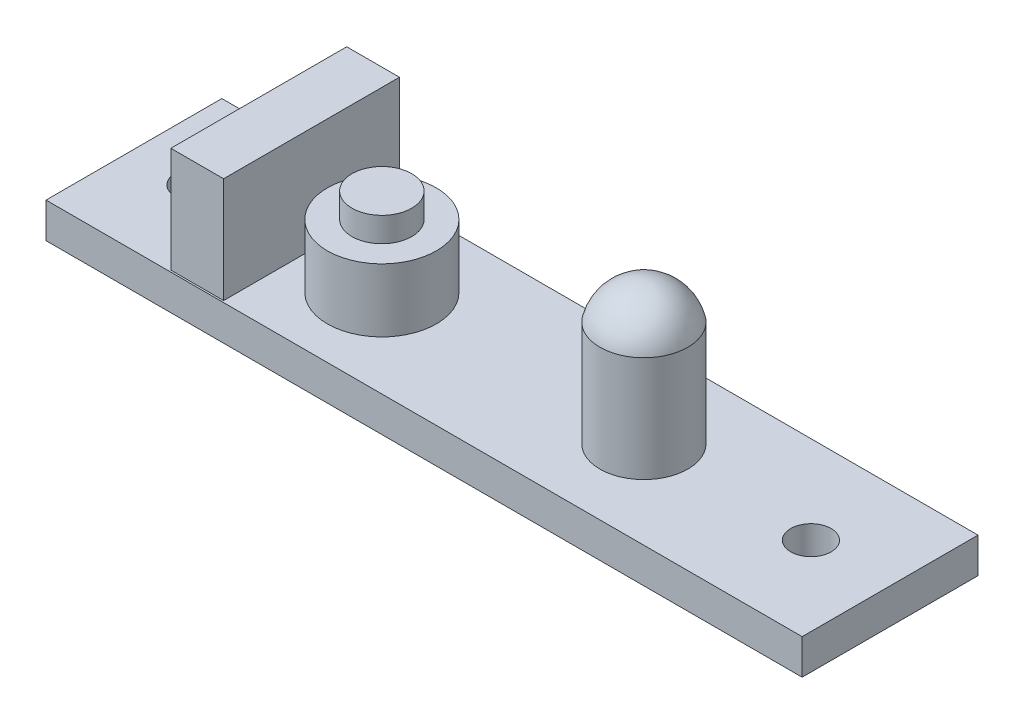
ISO-10303-21;
HEADER;
FILE_DESCRIPTION(('STEP AP214'),'2;1');
FILE_NAME('part.step','',(''),(''),'','','');
FILE_SCHEMA(('AUTOMOTIVE_DESIGN { 1 0 10303 214 1 1 1 1 }'));
ENDSEC;
DATA;
#1=APPLICATION_CONTEXT('core data for automotive mechanical design processes');
#2=APPLICATION_PROTOCOL_DEFINITION('international standard','automotive_design',2000,#1);
#3=PRODUCT_CONTEXT('',#1,'mechanical');
#4=PRODUCT('Part','Part','',(#3));
#5=PRODUCT_RELATED_PRODUCT_CATEGORY('part','',(#4));
#6=PRODUCT_DEFINITION_FORMATION('','',#4);
#7=PRODUCT_DEFINITION_CONTEXT('part definition',#1,'design');
#8=PRODUCT_DEFINITION('design','',#6,#7);
#9=PRODUCT_DEFINITION_SHAPE('','',#8);
#10=(LENGTH_UNIT() NAMED_UNIT(*) SI_UNIT(.MILLI.,.METRE.));
#11=(NAMED_UNIT(*) PLANE_ANGLE_UNIT() SI_UNIT($,.RADIAN.));
#12=(NAMED_UNIT(*) SI_UNIT($,.STERADIAN.) SOLID_ANGLE_UNIT());
#13=UNCERTAINTY_MEASURE_WITH_UNIT(LENGTH_MEASURE(1.E-05),#10,'distance_accuracy_value','');
#14=(GEOMETRIC_REPRESENTATION_CONTEXT(3) GLOBAL_UNCERTAINTY_ASSIGNED_CONTEXT((#13)) GLOBAL_UNIT_ASSIGNED_CONTEXT((#10,
#11,#12)) REPRESENTATION_CONTEXT('',''));
#15=CARTESIAN_POINT('',(0.,0.,0.));
#16=DIRECTION('',(0.,0.,1.));
#17=DIRECTION('',(1.,0.,0.));
#18=AXIS2_PLACEMENT_3D('',#15,#16,#17);
#19=CARTESIAN_POINT('',(21.5,2.,-5.));
#20=DIRECTION('',(-1.,0.,0.));
#21=DIRECTION('',(0.,0.,1.));
#22=AXIS2_PLACEMENT_3D('',#19,#20,#21);
#23=PLANE('',#22);
#24=DIRECTION('',(0.,0.,-1.));
#25=VECTOR('',#24,1.);
#26=CARTESIAN_POINT('',(21.5,0.,-5.));
#27=LINE('',#26,#25);
#28=CARTESIAN_POINT('',(21.5,0.,5.));
#29=VERTEX_POINT('',#28);
#30=CARTESIAN_POINT('',(21.5,0.,-5.));
#31=VERTEX_POINT('',#30);
#32=EDGE_CURVE('E126',#29,#31,#27,.T.);
#33=ORIENTED_EDGE('',*,*,#32,.T.);
#34=DIRECTION('',(0.,-1.,0.));
#35=VECTOR('',#34,1.);
#36=CARTESIAN_POINT('',(21.5,2.,-5.));
#37=LINE('',#36,#35);
#38=CARTESIAN_POINT('',(21.5,2.,-5.));
#39=VERTEX_POINT('',#38);
#40=EDGE_CURVE('E42',#39,#31,#37,.T.);
#41=ORIENTED_EDGE('',*,*,#40,.F.);
#42=DIRECTION('',(0.,0.,-1.));
#43=VECTOR('',#42,1.);
#44=CARTESIAN_POINT('',(21.5,2.,-5.));
#45=LINE('',#44,#43);
#46=CARTESIAN_POINT('',(21.5,2.,5.));
#47=VERTEX_POINT('',#46);
#48=EDGE_CURVE('E135',#47,#39,#45,.T.);
#49=ORIENTED_EDGE('',*,*,#48,.F.);
#50=DIRECTION('',(0.,-1.,0.));
#51=VECTOR('',#50,1.);
#52=CARTESIAN_POINT('',(21.5,2.,5.));
#53=LINE('',#52,#51);
#54=EDGE_CURVE('E147',#47,#29,#53,.T.);
#55=ORIENTED_EDGE('',*,*,#54,.T.);
#56=EDGE_LOOP('',(#33,#41,#49,#55));
#57=FACE_BOUND('',#56,.T.);
#58=ADVANCED_FACE('F33',(#57),#23,.F.);
#59=CARTESIAN_POINT('',(-21.5,2.,-5.));
#60=DIRECTION('',(0.,0.,1.));
#61=DIRECTION('',(1.,0.,0.));
#62=AXIS2_PLACEMENT_3D('',#59,#60,#61);
#63=PLANE('',#62);
#64=DIRECTION('',(-1.,0.,0.));
#65=VECTOR('',#64,1.);
#66=CARTESIAN_POINT('',(-21.5,0.,-5.));
#67=LINE('',#66,#65);
#68=CARTESIAN_POINT('',(-21.5,0.,-5.));
#69=VERTEX_POINT('',#68);
#70=EDGE_CURVE('E129',#31,#69,#67,.T.);
#71=ORIENTED_EDGE('',*,*,#70,.T.);
#72=DIRECTION('',(0.,-1.,0.));
#73=VECTOR('',#72,1.);
#74=CARTESIAN_POINT('',(-21.5,2.,-5.));
#75=LINE('',#74,#73);
#76=CARTESIAN_POINT('',(-21.5,2.,-5.));
#77=VERTEX_POINT('',#76);
#78=EDGE_CURVE('E158',#77,#69,#75,.T.);
#79=ORIENTED_EDGE('',*,*,#78,.F.);
#80=DIRECTION('',(-1.,0.,0.));
#81=VECTOR('',#80,1.);
#82=CARTESIAN_POINT('',(-21.5,2.,-5.));
#83=LINE('',#82,#81);
#84=CARTESIAN_POINT('',(-14.5,2.,-5.));
#85=VERTEX_POINT('',#84);
#86=EDGE_CURVE('E138',#85,#77,#83,.T.);
#87=ORIENTED_EDGE('',*,*,#86,.F.);
#88=CARTESIAN_POINT('',(-11.5,2.,-5.));
#89=VERTEX_POINT('',#88);
#90=EDGE_CURVE('E144',#89,#85,#83,.T.);
#91=ORIENTED_EDGE('',*,*,#90,.F.);
#92=EDGE_CURVE('E140',#39,#89,#83,.T.);
#93=ORIENTED_EDGE('',*,*,#92,.F.);
#94=ORIENTED_EDGE('',*,*,#40,.T.);
#95=EDGE_LOOP('',(#71,#79,#87,#91,#93,#94));
#96=FACE_BOUND('',#95,.T.);
#97=ADVANCED_FACE('F163',(#96),#63,.F.);
#98=CARTESIAN_POINT('',(-21.5,2.,-5.));
#99=DIRECTION('',(1.,0.,0.));
#100=DIRECTION('',(0.,0.,-1.));
#101=AXIS2_PLACEMENT_3D('',#98,#99,#100);
#102=PLANE('',#101);
#103=DIRECTION('',(0.,0.,1.));
#104=VECTOR('',#103,1.);
#105=CARTESIAN_POINT('',(-21.5,0.,-5.));
#106=LINE('',#105,#104);
#107=CARTESIAN_POINT('',(-21.5,0.,5.));
#108=VERTEX_POINT('',#107);
#109=EDGE_CURVE('E150',#69,#108,#106,.T.);
#110=ORIENTED_EDGE('',*,*,#109,.T.);
#111=DIRECTION('',(0.,-1.,0.));
#112=VECTOR('',#111,1.);
#113=CARTESIAN_POINT('',(-21.5,2.,5.));
#114=LINE('',#113,#112);
#115=CARTESIAN_POINT('',(-21.5,2.,5.));
#116=VERTEX_POINT('',#115);
#117=EDGE_CURVE('E155',#116,#108,#114,.T.);
#118=ORIENTED_EDGE('',*,*,#117,.F.);
#119=DIRECTION('',(0.,0.,1.));
#120=VECTOR('',#119,1.);
#121=CARTESIAN_POINT('',(-21.5,2.,-5.));
#122=LINE('',#121,#120);
#123=EDGE_CURVE('E143',#77,#116,#122,.T.);
#124=ORIENTED_EDGE('',*,*,#123,.F.);
#125=ORIENTED_EDGE('',*,*,#78,.T.);
#126=EDGE_LOOP('',(#110,#118,#124,#125));
#127=FACE_BOUND('',#126,.T.);
#128=ADVANCED_FACE('F175',(#127),#102,.F.);
#129=CARTESIAN_POINT('',(-21.5,2.,5.));
#130=DIRECTION('',(0.,0.,-1.));
#131=DIRECTION('',(-1.,0.,0.));
#132=AXIS2_PLACEMENT_3D('',#129,#130,#131);
#133=PLANE('',#132);
#134=DIRECTION('',(1.,0.,0.));
#135=VECTOR('',#134,1.);
#136=CARTESIAN_POINT('',(-21.5,0.,5.));
#137=LINE('',#136,#135);
#138=EDGE_CURVE('E139',#108,#29,#137,.T.);
#139=ORIENTED_EDGE('',*,*,#138,.T.);
#140=ORIENTED_EDGE('',*,*,#54,.F.);
#141=DIRECTION('',(1.,0.,0.));
#142=VECTOR('',#141,1.);
#143=CARTESIAN_POINT('',(-21.5,2.,5.));
#144=LINE('',#143,#142);
#145=EDGE_CURVE('E146',#116,#47,#144,.T.);
#146=ORIENTED_EDGE('',*,*,#145,.F.);
#147=ORIENTED_EDGE('',*,*,#117,.T.);
#148=EDGE_LOOP('',(#139,#140,#146,#147));
#149=FACE_BOUND('',#148,.T.);
#150=ADVANCED_FACE('F179',(#149),#133,.F.);
#151=CARTESIAN_POINT('',(0.,2.,0.));
#152=DIRECTION('',(0.,1.,0.));
#153=DIRECTION('',(0.,0.,1.));
#154=AXIS2_PLACEMENT_3D('',#151,#152,#153);
#155=PLANE('',#154);
#156=CARTESIAN_POINT('',(17.,2.,0.));
#157=DIRECTION('',(0.,1.,0.));
#158=DIRECTION('',(0.,0.,1.));
#159=AXIS2_PLACEMENT_3D('',#156,#157,#158);
#160=CIRCLE('',#159,1.15);
#161=CARTESIAN_POINT('',(17.,2.,1.15));
#162=VERTEX_POINT('',#161);
#163=EDGE_CURVE('E225',#162,#162,#160,.T.);
#164=ORIENTED_EDGE('',*,*,#163,.F.);
#165=EDGE_LOOP('',(#164));
#166=FACE_BOUND('',#165,.T.);
#167=CARTESIAN_POINT('',(-18.,2.,0.));
#168=DIRECTION('',(0.,1.,0.));
#169=DIRECTION('',(0.,0.,1.));
#170=AXIS2_PLACEMENT_3D('',#167,#168,#169);
#171=CIRCLE('',#170,1.15);
#172=CARTESIAN_POINT('',(-18.,2.,1.15));
#173=VERTEX_POINT('',#172);
#174=EDGE_CURVE('E219',#173,#173,#171,.T.);
#175=ORIENTED_EDGE('',*,*,#174,.F.);
#176=EDGE_LOOP('',(#175));
#177=FACE_BOUND('',#176,.T.);
#178=CARTESIAN_POINT('',(7.49999999999998,2.,0.));
#179=DIRECTION('',(0.,1.,0.));
#180=DIRECTION('',(0.,0.,1.));
#181=AXIS2_PLACEMENT_3D('',#178,#179,#180);
#182=CIRCLE('',#181,2.5);
#183=CARTESIAN_POINT('',(7.49999999999998,2.,2.5));
#184=VERTEX_POINT('',#183);
#185=EDGE_CURVE('E216',#184,#184,#182,.T.);
#186=ORIENTED_EDGE('',*,*,#185,.F.);
#187=EDGE_LOOP('',(#186));
#188=FACE_BOUND('',#187,.T.);
#189=CARTESIAN_POINT('',(-7.40000000000001,2.,0.));
#190=DIRECTION('',(0.,1.,0.));
#191=DIRECTION('',(0.,0.,1.));
#192=AXIS2_PLACEMENT_3D('',#189,#190,#191);
#193=CIRCLE('',#192,3.1);
#194=CARTESIAN_POINT('',(-7.40000000000001,2.,3.1));
#195=VERTEX_POINT('',#194);
#196=EDGE_CURVE('E193',#195,#195,#193,.T.);
#197=ORIENTED_EDGE('',*,*,#196,.F.);
#198=EDGE_LOOP('',(#197));
#199=FACE_BOUND('',#198,.T.);
#200=DIRECTION('',(0.,0.,1.));
#201=VECTOR('',#200,1.);
#202=CARTESIAN_POINT('',(-14.5,2.,4.9));
#203=LINE('',#202,#201);
#204=CARTESIAN_POINT('',(-14.5,2.,4.9));
#205=VERTEX_POINT('',#204);
#206=EDGE_CURVE('E11',#85,#205,#203,.T.);
#207=ORIENTED_EDGE('',*,*,#206,.F.);
#208=ORIENTED_EDGE('',*,*,#86,.T.);
#209=ORIENTED_EDGE('',*,*,#123,.T.);
#210=ORIENTED_EDGE('',*,*,#145,.T.);
#211=ORIENTED_EDGE('',*,*,#48,.T.);
#212=ORIENTED_EDGE('',*,*,#92,.T.);
#213=DIRECTION('',(0.,0.,-1.));
#214=VECTOR('',#213,1.);
#215=CARTESIAN_POINT('',(-11.5,2.,4.9));
#216=LINE('',#215,#214);
#217=CARTESIAN_POINT('',(-11.5,2.,4.9));
#218=VERTEX_POINT('',#217);
#219=EDGE_CURVE('E198',#218,#89,#216,.T.);
#220=ORIENTED_EDGE('',*,*,#219,.F.);
#221=DIRECTION('',(1.,0.,0.));
#222=VECTOR('',#221,1.);
#223=CARTESIAN_POINT('',(-14.5,2.,4.9));
#224=LINE('',#223,#222);
#225=EDGE_CURVE('E51',#205,#218,#224,.T.);
#226=ORIENTED_EDGE('',*,*,#225,.F.);
#227=EDGE_LOOP('',(#207,#208,#209,#210,#211,#212,#220,#226));
#228=FACE_BOUND('',#227,.T.);
#229=ADVANCED_FACE('F180',(#166,#177,#188,#199,#228),#155,.T.);
#230=CARTESIAN_POINT('',(0.,0.,0.));
#231=DIRECTION('',(0.,1.,0.));
#232=DIRECTION('',(0.,0.,1.));
#233=AXIS2_PLACEMENT_3D('',#230,#231,#232);
#234=PLANE('',#233);
#235=CARTESIAN_POINT('',(17.,0.,0.));
#236=DIRECTION('',(0.,1.,0.));
#237=DIRECTION('',(0.,0.,1.));
#238=AXIS2_PLACEMENT_3D('',#235,#236,#237);
#239=CIRCLE('',#238,1.15);
#240=CARTESIAN_POINT('',(17.,0.,1.15));
#241=VERTEX_POINT('',#240);
#242=EDGE_CURVE('E228',#241,#241,#239,.T.);
#243=ORIENTED_EDGE('',*,*,#242,.T.);
#244=EDGE_LOOP('',(#243));
#245=FACE_BOUND('',#244,.T.);
#246=CARTESIAN_POINT('',(-18.,0.,0.));
#247=DIRECTION('',(0.,1.,0.));
#248=DIRECTION('',(0.,0.,1.));
#249=AXIS2_PLACEMENT_3D('',#246,#247,#248);
#250=CIRCLE('',#249,1.15);
#251=CARTESIAN_POINT('',(-18.,0.,1.15));
#252=VERTEX_POINT('',#251);
#253=EDGE_CURVE('E222',#252,#252,#250,.T.);
#254=ORIENTED_EDGE('',*,*,#253,.T.);
#255=EDGE_LOOP('',(#254));
#256=FACE_BOUND('',#255,.T.);
#257=ORIENTED_EDGE('',*,*,#32,.F.);
#258=ORIENTED_EDGE('',*,*,#138,.F.);
#259=ORIENTED_EDGE('',*,*,#109,.F.);
#260=ORIENTED_EDGE('',*,*,#70,.F.);
#261=EDGE_LOOP('',(#257,#258,#259,#260));
#262=FACE_BOUND('',#261,.T.);
#263=ADVANCED_FACE('F171',(#245,#256,#262),#234,.F.);
#264=CARTESIAN_POINT('',(-14.5,8.,4.9));
#265=DIRECTION('',(1.,0.,0.));
#266=DIRECTION('',(0.,0.,-1.));
#267=AXIS2_PLACEMENT_3D('',#264,#265,#266);
#268=PLANE('',#267);
#269=CARTESIAN_POINT('',(-14.5,2.,-5.1));
#270=VERTEX_POINT('',#269);
#271=EDGE_CURVE('E44',#270,#85,#203,.T.);
#272=ORIENTED_EDGE('',*,*,#271,.T.);
#273=ORIENTED_EDGE('',*,*,#206,.T.);
#274=DIRECTION('',(0.,-1.,0.));
#275=VECTOR('',#274,1.);
#276=CARTESIAN_POINT('',(-14.5,8.,4.9));
#277=LINE('',#276,#275);
#278=CARTESIAN_POINT('',(-14.5,8.,4.9));
#279=VERTEX_POINT('',#278);
#280=EDGE_CURVE('E107',#279,#205,#277,.T.);
#281=ORIENTED_EDGE('',*,*,#280,.F.);
#282=DIRECTION('',(0.,0.,1.));
#283=VECTOR('',#282,1.);
#284=CARTESIAN_POINT('',(-14.5,8.,4.9));
#285=LINE('',#284,#283);
#286=CARTESIAN_POINT('',(-14.5,8.,-5.1));
#287=VERTEX_POINT('',#286);
#288=EDGE_CURVE('E113',#287,#279,#285,.T.);
#289=ORIENTED_EDGE('',*,*,#288,.F.);
#290=DIRECTION('',(0.,-1.,0.));
#291=VECTOR('',#290,1.);
#292=CARTESIAN_POINT('',(-14.5,8.,-5.1));
#293=LINE('',#292,#291);
#294=EDGE_CURVE('E189',#287,#270,#293,.T.);
#295=ORIENTED_EDGE('',*,*,#294,.T.);
#296=EDGE_LOOP('',(#272,#273,#281,#289,#295));
#297=FACE_BOUND('',#296,.T.);
#298=ADVANCED_FACE('F125',(#297),#268,.F.);
#299=CARTESIAN_POINT('',(-14.5,8.,4.9));
#300=DIRECTION('',(0.,0.,-1.));
#301=DIRECTION('',(-1.,0.,0.));
#302=AXIS2_PLACEMENT_3D('',#299,#300,#301);
#303=PLANE('',#302);
#304=ORIENTED_EDGE('',*,*,#225,.T.);
#305=DIRECTION('',(0.,-1.,0.));
#306=VECTOR('',#305,1.);
#307=CARTESIAN_POINT('',(-11.5,8.,4.9));
#308=LINE('',#307,#306);
#309=CARTESIAN_POINT('',(-11.5,8.,4.9));
#310=VERTEX_POINT('',#309);
#311=EDGE_CURVE('E109',#310,#218,#308,.T.);
#312=ORIENTED_EDGE('',*,*,#311,.F.);
#313=DIRECTION('',(1.,0.,0.));
#314=VECTOR('',#313,1.);
#315=CARTESIAN_POINT('',(-14.5,8.,4.9));
#316=LINE('',#315,#314);
#317=EDGE_CURVE('E103',#279,#310,#316,.T.);
#318=ORIENTED_EDGE('',*,*,#317,.F.);
#319=ORIENTED_EDGE('',*,*,#280,.T.);
#320=EDGE_LOOP('',(#304,#312,#318,#319));
#321=FACE_BOUND('',#320,.T.);
#322=ADVANCED_FACE('F105',(#321),#303,.F.);
#323=CARTESIAN_POINT('',(-11.5,8.,4.9));
#324=DIRECTION('',(-1.,0.,0.));
#325=DIRECTION('',(0.,0.,1.));
#326=AXIS2_PLACEMENT_3D('',#323,#324,#325);
#327=PLANE('',#326);
#328=ORIENTED_EDGE('',*,*,#219,.T.);
#329=CARTESIAN_POINT('',(-11.5,2.,-5.1));
#330=VERTEX_POINT('',#329);
#331=EDGE_CURVE('E187',#89,#330,#216,.T.);
#332=ORIENTED_EDGE('',*,*,#331,.T.);
#333=DIRECTION('',(0.,-1.,0.));
#334=VECTOR('',#333,1.);
#335=CARTESIAN_POINT('',(-11.5,8.,-5.1));
#336=LINE('',#335,#334);
#337=CARTESIAN_POINT('',(-11.5,8.,-5.1));
#338=VERTEX_POINT('',#337);
#339=EDGE_CURVE('E131',#338,#330,#336,.T.);
#340=ORIENTED_EDGE('',*,*,#339,.F.);
#341=DIRECTION('',(0.,0.,-1.));
#342=VECTOR('',#341,1.);
#343=CARTESIAN_POINT('',(-11.5,8.,4.9));
#344=LINE('',#343,#342);
#345=EDGE_CURVE('E112',#310,#338,#344,.T.);
#346=ORIENTED_EDGE('',*,*,#345,.F.);
#347=ORIENTED_EDGE('',*,*,#311,.T.);
#348=EDGE_LOOP('',(#328,#332,#340,#346,#347));
#349=FACE_BOUND('',#348,.T.);
#350=ADVANCED_FACE('F206',(#349),#327,.F.);
#351=CARTESIAN_POINT('',(-14.5,8.,-5.1));
#352=DIRECTION('',(0.,0.,1.));
#353=DIRECTION('',(1.,0.,0.));
#354=AXIS2_PLACEMENT_3D('',#351,#352,#353);
#355=PLANE('',#354);
#356=DIRECTION('',(-1.,0.,0.));
#357=VECTOR('',#356,1.);
#358=CARTESIAN_POINT('',(-14.5,2.,-5.1));
#359=LINE('',#358,#357);
#360=EDGE_CURVE('E122',#330,#270,#359,.T.);
#361=ORIENTED_EDGE('',*,*,#360,.T.);
#362=ORIENTED_EDGE('',*,*,#294,.F.);
#363=DIRECTION('',(-1.,0.,0.));
#364=VECTOR('',#363,1.);
#365=CARTESIAN_POINT('',(-14.5,8.,-5.1));
#366=LINE('',#365,#364);
#367=EDGE_CURVE('E118',#338,#287,#366,.T.);
#368=ORIENTED_EDGE('',*,*,#367,.F.);
#369=ORIENTED_EDGE('',*,*,#339,.T.);
#370=EDGE_LOOP('',(#361,#362,#368,#369));
#371=FACE_BOUND('',#370,.T.);
#372=ADVANCED_FACE('F204',(#371),#355,.F.);
#373=CARTESIAN_POINT('',(0.,8.,0.));
#374=DIRECTION('',(0.,-1.,0.));
#375=DIRECTION('',(0.,0.,-1.));
#376=AXIS2_PLACEMENT_3D('',#373,#374,#375);
#377=PLANE('',#376);
#378=ORIENTED_EDGE('',*,*,#288,.T.);
#379=ORIENTED_EDGE('',*,*,#317,.T.);
#380=ORIENTED_EDGE('',*,*,#345,.T.);
#381=ORIENTED_EDGE('',*,*,#367,.T.);
#382=EDGE_LOOP('',(#378,#379,#380,#381));
#383=FACE_BOUND('',#382,.T.);
#384=ADVANCED_FACE('F116',(#383),#377,.F.);
#385=CARTESIAN_POINT('',(0.,2.,0.));
#386=DIRECTION('',(0.,-1.,0.));
#387=DIRECTION('',(0.,0.,-1.));
#388=AXIS2_PLACEMENT_3D('',#385,#386,#387);
#389=PLANE('',#388);
#390=ORIENTED_EDGE('',*,*,#331,.F.);
#391=ORIENTED_EDGE('',*,*,#90,.T.);
#392=ORIENTED_EDGE('',*,*,#271,.F.);
#393=ORIENTED_EDGE('',*,*,#360,.F.);
#394=EDGE_LOOP('',(#390,#391,#392,#393));
#395=FACE_BOUND('',#394,.T.);
#396=ADVANCED_FACE('F185',(#395),#389,.T.);
#397=CARTESIAN_POINT('',(-7.40000000000001,5.6,0.));
#398=DIRECTION('',(0.,-1.,0.));
#399=DIRECTION('',(0.,0.,-1.));
#400=AXIS2_PLACEMENT_3D('',#397,#398,#399);
#401=CYLINDRICAL_SURFACE('',#400,3.1);
#402=CARTESIAN_POINT('',(-7.40000000000001,5.6,0.));
#403=DIRECTION('',(0.,1.,0.));
#404=DIRECTION('',(0.,0.,1.));
#405=AXIS2_PLACEMENT_3D('',#402,#403,#404);
#406=CIRCLE('',#405,3.1);
#407=CARTESIAN_POINT('',(-7.40000000000001,5.6,3.1));
#408=VERTEX_POINT('',#407);
#409=EDGE_CURVE('E190',#408,#408,#406,.T.);
#410=ORIENTED_EDGE('',*,*,#409,.F.);
#411=EDGE_LOOP('',(#410));
#412=FACE_BOUND('',#411,.T.);
#413=ORIENTED_EDGE('',*,*,#196,.T.);
#414=EDGE_LOOP('',(#413));
#415=FACE_BOUND('',#414,.T.);
#416=ADVANCED_FACE('F269',(#412,#415),#401,.T.);
#417=CARTESIAN_POINT('',(-7.40000000000001,5.6,0.));
#418=DIRECTION('',(0.,1.,0.));
#419=DIRECTION('',(0.,0.,1.));
#420=AXIS2_PLACEMENT_3D('',#417,#418,#419);
#421=PLANE('',#420);
#422=CARTESIAN_POINT('',(-7.40000000000001,5.6,0.));
#423=DIRECTION('',(0.,1.,0.));
#424=DIRECTION('',(0.,0.,1.));
#425=AXIS2_PLACEMENT_3D('',#422,#423,#424);
#426=CIRCLE('',#425,1.7);
#427=CARTESIAN_POINT('',(-7.40000000000001,5.6,1.7));
#428=VERTEX_POINT('',#427);
#429=EDGE_CURVE('E211',#428,#428,#426,.T.);
#430=ORIENTED_EDGE('',*,*,#429,.F.);
#431=EDGE_LOOP('',(#430));
#432=FACE_BOUND('',#431,.T.);
#433=ORIENTED_EDGE('',*,*,#409,.T.);
#434=EDGE_LOOP('',(#433));
#435=FACE_BOUND('',#434,.T.);
#436=ADVANCED_FACE('F274',(#432,#435),#421,.T.);
#437=CARTESIAN_POINT('',(-7.40000000000001,7.,0.));
#438=DIRECTION('',(0.,-1.,0.));
#439=DIRECTION('',(0.,0.,-1.));
#440=AXIS2_PLACEMENT_3D('',#437,#438,#439);
#441=CYLINDRICAL_SURFACE('',#440,1.7);
#442=CARTESIAN_POINT('',(-7.40000000000001,7.,0.));
#443=DIRECTION('',(0.,1.,0.));
#444=DIRECTION('',(0.,0.,1.));
#445=AXIS2_PLACEMENT_3D('',#442,#443,#444);
#446=CIRCLE('',#445,1.7);
#447=CARTESIAN_POINT('',(-7.40000000000001,7.,1.7));
#448=VERTEX_POINT('',#447);
#449=EDGE_CURVE('E209',#448,#448,#446,.T.);
#450=ORIENTED_EDGE('',*,*,#449,.F.);
#451=EDGE_LOOP('',(#450));
#452=FACE_BOUND('',#451,.T.);
#453=ORIENTED_EDGE('',*,*,#429,.T.);
#454=EDGE_LOOP('',(#453));
#455=FACE_BOUND('',#454,.T.);
#456=ADVANCED_FACE('F278',(#452,#455),#441,.T.);
#457=CARTESIAN_POINT('',(-7.40000000000001,7.,0.));
#458=DIRECTION('',(0.,1.,0.));
#459=DIRECTION('',(0.,0.,1.));
#460=AXIS2_PLACEMENT_3D('',#457,#458,#459);
#461=PLANE('',#460);
#462=ORIENTED_EDGE('',*,*,#449,.T.);
#463=EDGE_LOOP('',(#462));
#464=FACE_BOUND('',#463,.T.);
#465=ADVANCED_FACE('F282',(#464),#461,.T.);
#466=CARTESIAN_POINT('',(7.49999999999998,8.,0.));
#467=DIRECTION('',(0.,-1.,0.));
#468=DIRECTION('',(0.,0.,-1.));
#469=AXIS2_PLACEMENT_3D('',#466,#467,#468);
#470=CYLINDRICAL_SURFACE('',#469,2.5);
#471=CARTESIAN_POINT('',(7.49999999999998,8.,0.));
#472=DIRECTION('',(0.,1.,0.));
#473=DIRECTION('',(0.,0.,1.));
#474=AXIS2_PLACEMENT_3D('',#471,#472,#473);
#475=CIRCLE('',#474,2.5);
#476=CARTESIAN_POINT('',(7.49999999999998,8.,2.5));
#477=VERTEX_POINT('',#476);
#478=EDGE_CURVE('E37',#477,#477,#475,.T.);
#479=ORIENTED_EDGE('',*,*,#478,.F.);
#480=EDGE_LOOP('',(#479));
#481=FACE_BOUND('',#480,.T.);
#482=ORIENTED_EDGE('',*,*,#185,.T.);
#483=EDGE_LOOP('',(#482));
#484=FACE_BOUND('',#483,.T.);
#485=ADVANCED_FACE('F286',(#481,#484),#470,.T.);
#486=CARTESIAN_POINT('',(7.49999999999998,7.4375,0.));
#487=DIRECTION('',(0.,0.,1.));
#488=DIRECTION('',(1.,0.,0.));
#489=AXIS2_PLACEMENT_3D('',#486,#487,#488);
#490=SPHERICAL_SURFACE('',#489,2.5625);
#491=CARTESIAN_POINT('',(7.49999999999998,7.4375,0.));
#492=DIRECTION('',(0.,1.,0.));
#493=DIRECTION('',(0.,0.,1.));
#494=AXIS2_PLACEMENT_3D('',#491,#492,#493);
#495=SPHERICAL_SURFACE('',#494,2.5625);
#496=ORIENTED_EDGE('',*,*,#478,.T.);
#497=EDGE_LOOP('',(#496));
#498=FACE_BOUND('',#497,.T.);
#499=ADVANCED_FACE('F35',(#498),#495,.T.);
#500=CARTESIAN_POINT('',(-18.,0.,0.));
#501=DIRECTION('',(0.,1.,0.));
#502=DIRECTION('',(0.,0.,1.));
#503=AXIS2_PLACEMENT_3D('',#500,#501,#502);
#504=CYLINDRICAL_SURFACE('',#503,1.15);
#505=ORIENTED_EDGE('',*,*,#174,.T.);
#506=EDGE_LOOP('',(#505));
#507=FACE_BOUND('',#506,.T.);
#508=ORIENTED_EDGE('',*,*,#253,.F.);
#509=EDGE_LOOP('',(#508));
#510=FACE_BOUND('',#509,.T.);
#511=ADVANCED_FACE('F236',(#507,#510),#504,.F.);
#512=CARTESIAN_POINT('',(17.,0.,0.));
#513=DIRECTION('',(0.,1.,0.));
#514=DIRECTION('',(0.,0.,1.));
#515=AXIS2_PLACEMENT_3D('',#512,#513,#514);
#516=CYLINDRICAL_SURFACE('',#515,1.15);
#517=ORIENTED_EDGE('',*,*,#163,.T.);
#518=EDGE_LOOP('',(#517));
#519=FACE_BOUND('',#518,.T.);
#520=ORIENTED_EDGE('',*,*,#242,.F.);
#521=EDGE_LOOP('',(#520));
#522=FACE_BOUND('',#521,.T.);
#523=ADVANCED_FACE('F234',(#519,#522),#516,.F.);
#524=CLOSED_SHELL('',(#58,#97,#128,#150,#229,#263,#298,#322,#350,#372,#384,#396,#416,#436,#456,
#465,#485,#499,#511,#523));
#525=MANIFOLD_SOLID_BREP('B2',#524);
#526=ADVANCED_BREP_SHAPE_REPRESENTATION('',(#18,#525),#14);
#527=SHAPE_DEFINITION_REPRESENTATION(#9,#526);
ENDSEC;
END-ISO-10303-21;
